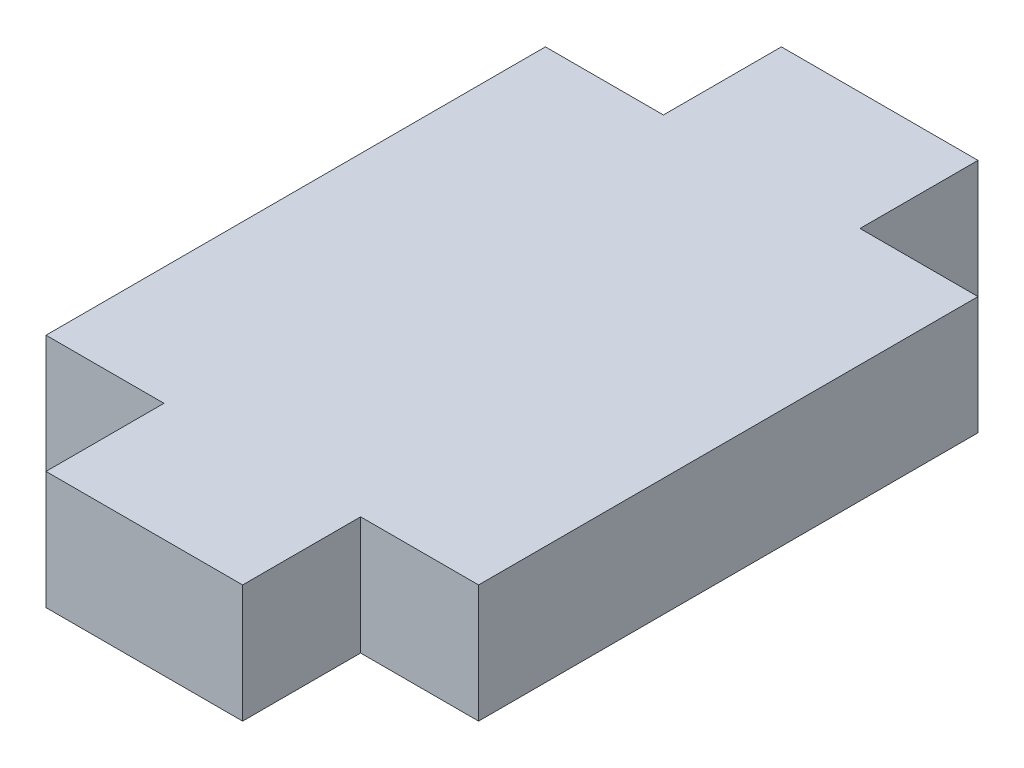
ISO-10303-21;
HEADER;
FILE_DESCRIPTION(('STEP AP214'),'2;1');
FILE_NAME('part.step','',(''),(''),'','','');
FILE_SCHEMA(('AUTOMOTIVE_DESIGN { 1 0 10303 214 1 1 1 1 }'));
ENDSEC;
DATA;
#1=APPLICATION_CONTEXT('core data for automotive mechanical design processes');
#2=APPLICATION_PROTOCOL_DEFINITION('international standard','automotive_design',2000,#1);
#3=PRODUCT_CONTEXT('',#1,'mechanical');
#4=PRODUCT('Part','Part','',(#3));
#5=PRODUCT_RELATED_PRODUCT_CATEGORY('part','',(#4));
#6=PRODUCT_DEFINITION_FORMATION('','',#4);
#7=PRODUCT_DEFINITION_CONTEXT('part definition',#1,'design');
#8=PRODUCT_DEFINITION('design','',#6,#7);
#9=PRODUCT_DEFINITION_SHAPE('','',#8);
#10=(LENGTH_UNIT() NAMED_UNIT(*) SI_UNIT(.MILLI.,.METRE.));
#11=(NAMED_UNIT(*) PLANE_ANGLE_UNIT() SI_UNIT($,.RADIAN.));
#12=(NAMED_UNIT(*) SI_UNIT($,.STERADIAN.) SOLID_ANGLE_UNIT());
#13=UNCERTAINTY_MEASURE_WITH_UNIT(LENGTH_MEASURE(1.E-05),#10,'distance_accuracy_value','');
#14=(GEOMETRIC_REPRESENTATION_CONTEXT(3) GLOBAL_UNCERTAINTY_ASSIGNED_CONTEXT((#13)) GLOBAL_UNIT_ASSIGNED_CONTEXT((#10,
#11,#12)) REPRESENTATION_CONTEXT('',''));
#15=CARTESIAN_POINT('',(0.,0.,0.));
#16=DIRECTION('',(0.,0.,1.));
#17=DIRECTION('',(1.,0.,0.));
#18=AXIS2_PLACEMENT_3D('',#15,#16,#17);
#19=CARTESIAN_POINT('',(-2.5,1.5,-6.35));
#20=DIRECTION('',(0.,0.,1.));
#21=DIRECTION('',(1.,0.,0.));
#22=AXIS2_PLACEMENT_3D('',#19,#20,#21);
#23=PLANE('',#22);
#24=DIRECTION('',(-1.,0.,0.));
#25=VECTOR('',#24,1.);
#26=CARTESIAN_POINT('',(-2.5,-1.5,-6.35));
#27=LINE('',#26,#25);
#28=CARTESIAN_POINT('',(-2.5,-1.5,-6.35));
#29=VERTEX_POINT('',#28);
#30=CARTESIAN_POINT('',(-5.5,-1.5,-6.35));
#31=VERTEX_POINT('',#30);
#32=EDGE_CURVE('E161',#29,#31,#27,.T.);
#33=ORIENTED_EDGE('',*,*,#32,.T.);
#34=DIRECTION('',(0.,-1.,0.));
#35=VECTOR('',#34,1.);
#36=CARTESIAN_POINT('',(-5.5,1.5,-6.35));
#37=LINE('',#36,#35);
#38=CARTESIAN_POINT('',(-5.5,1.5,-6.35));
#39=VERTEX_POINT('',#38);
#40=EDGE_CURVE('E11',#39,#31,#37,.T.);
#41=ORIENTED_EDGE('',*,*,#40,.F.);
#42=DIRECTION('',(-1.,0.,0.));
#43=VECTOR('',#42,1.);
#44=CARTESIAN_POINT('',(-2.5,1.5,-6.35));
#45=LINE('',#44,#43);
#46=CARTESIAN_POINT('',(-2.5,1.5,-6.35));
#47=VERTEX_POINT('',#46);
#48=EDGE_CURVE('E183',#47,#39,#45,.T.);
#49=ORIENTED_EDGE('',*,*,#48,.F.);
#50=DIRECTION('',(0.,-1.,0.));
#51=VECTOR('',#50,1.);
#52=CARTESIAN_POINT('',(-2.5,1.5,-6.35));
#53=LINE('',#52,#51);
#54=EDGE_CURVE('E157',#47,#29,#53,.T.);
#55=ORIENTED_EDGE('',*,*,#54,.T.);
#56=EDGE_LOOP('',(#33,#41,#49,#55));
#57=FACE_BOUND('',#56,.T.);
#58=ADVANCED_FACE('F41',(#57),#23,.F.);
#59=CARTESIAN_POINT('',(-5.5,1.5,-6.35));
#60=DIRECTION('',(1.,0.,0.));
#61=DIRECTION('',(0.,0.,-1.));
#62=AXIS2_PLACEMENT_3D('',#59,#60,#61);
#63=PLANE('',#62);
#64=DIRECTION('',(0.,0.,1.));
#65=VECTOR('',#64,1.);
#66=CARTESIAN_POINT('',(-5.5,-1.5,-6.35));
#67=LINE('',#66,#65);
#68=CARTESIAN_POINT('',(-5.5,-1.5,6.35));
#69=VERTEX_POINT('',#68);
#70=EDGE_CURVE('E164',#31,#69,#67,.T.);
#71=ORIENTED_EDGE('',*,*,#70,.T.);
#72=DIRECTION('',(0.,-1.,0.));
#73=VECTOR('',#72,1.);
#74=CARTESIAN_POINT('',(-5.5,1.5,6.35));
#75=LINE('',#74,#73);
#76=CARTESIAN_POINT('',(-5.5,1.5,6.35));
#77=VERTEX_POINT('',#76);
#78=EDGE_CURVE('E49',#77,#69,#75,.T.);
#79=ORIENTED_EDGE('',*,*,#78,.F.);
#80=DIRECTION('',(0.,0.,1.));
#81=VECTOR('',#80,1.);
#82=CARTESIAN_POINT('',(-5.5,1.5,-6.35));
#83=LINE('',#82,#81);
#84=EDGE_CURVE('E112',#39,#77,#83,.T.);
#85=ORIENTED_EDGE('',*,*,#84,.F.);
#86=ORIENTED_EDGE('',*,*,#40,.T.);
#87=EDGE_LOOP('',(#71,#79,#85,#86));
#88=FACE_BOUND('',#87,.T.);
#89=ADVANCED_FACE('F261',(#88),#63,.F.);
#90=CARTESIAN_POINT('',(-5.5,1.5,6.35));
#91=DIRECTION('',(0.,0.,-1.));
#92=DIRECTION('',(-1.,0.,0.));
#93=AXIS2_PLACEMENT_3D('',#90,#91,#92);
#94=PLANE('',#93);
#95=DIRECTION('',(1.,0.,0.));
#96=VECTOR('',#95,1.);
#97=CARTESIAN_POINT('',(-5.5,-1.5,6.35));
#98=LINE('',#97,#96);
#99=CARTESIAN_POINT('',(-2.5,-1.5,6.35));
#100=VERTEX_POINT('',#99);
#101=EDGE_CURVE('E166',#69,#100,#98,.T.);
#102=ORIENTED_EDGE('',*,*,#101,.T.);
#103=DIRECTION('',(0.,-1.,0.));
#104=VECTOR('',#103,1.);
#105=CARTESIAN_POINT('',(-2.5,1.5,6.35));
#106=LINE('',#105,#104);
#107=CARTESIAN_POINT('',(-2.5,1.5,6.35));
#108=VERTEX_POINT('',#107);
#109=EDGE_CURVE('E202',#108,#100,#106,.T.);
#110=ORIENTED_EDGE('',*,*,#109,.F.);
#111=DIRECTION('',(1.,0.,0.));
#112=VECTOR('',#111,1.);
#113=CARTESIAN_POINT('',(-5.5,1.5,6.35));
#114=LINE('',#113,#112);
#115=EDGE_CURVE('E210',#77,#108,#114,.T.);
#116=ORIENTED_EDGE('',*,*,#115,.F.);
#117=ORIENTED_EDGE('',*,*,#78,.T.);
#118=EDGE_LOOP('',(#102,#110,#116,#117));
#119=FACE_BOUND('',#118,.T.);
#120=ADVANCED_FACE('F208',(#119),#94,.F.);
#121=CARTESIAN_POINT('',(-2.5,1.5,6.35));
#122=DIRECTION('',(1.,0.,0.));
#123=DIRECTION('',(0.,0.,-1.));
#124=AXIS2_PLACEMENT_3D('',#121,#122,#123);
#125=PLANE('',#124);
#126=DIRECTION('',(0.,0.,1.));
#127=VECTOR('',#126,1.);
#128=CARTESIAN_POINT('',(-2.5,-1.5,6.35));
#129=LINE('',#128,#127);
#130=CARTESIAN_POINT('',(-2.5,-1.5,9.35));
#131=VERTEX_POINT('',#130);
#132=EDGE_CURVE('E168',#100,#131,#129,.T.);
#133=ORIENTED_EDGE('',*,*,#132,.T.);
#134=DIRECTION('',(0.,-1.,0.));
#135=VECTOR('',#134,1.);
#136=CARTESIAN_POINT('',(-2.5,1.5,9.35));
#137=LINE('',#136,#135);
#138=CARTESIAN_POINT('',(-2.5,1.5,9.35));
#139=VERTEX_POINT('',#138);
#140=EDGE_CURVE('E199',#139,#131,#137,.T.);
#141=ORIENTED_EDGE('',*,*,#140,.F.);
#142=DIRECTION('',(0.,0.,1.));
#143=VECTOR('',#142,1.);
#144=CARTESIAN_POINT('',(-2.5,1.5,6.35));
#145=LINE('',#144,#143);
#146=EDGE_CURVE('E228',#108,#139,#145,.T.);
#147=ORIENTED_EDGE('',*,*,#146,.F.);
#148=ORIENTED_EDGE('',*,*,#109,.T.);
#149=EDGE_LOOP('',(#133,#141,#147,#148));
#150=FACE_BOUND('',#149,.T.);
#151=ADVANCED_FACE('F219',(#150),#125,.F.);
#152=CARTESIAN_POINT('',(-2.5,1.5,9.35));
#153=DIRECTION('',(0.,0.,-1.));
#154=DIRECTION('',(-1.,0.,0.));
#155=AXIS2_PLACEMENT_3D('',#152,#153,#154);
#156=PLANE('',#155);
#157=DIRECTION('',(1.,0.,0.));
#158=VECTOR('',#157,1.);
#159=CARTESIAN_POINT('',(-2.5,-1.5,9.35));
#160=LINE('',#159,#158);
#161=CARTESIAN_POINT('',(2.5,-1.5,9.35));
#162=VERTEX_POINT('',#161);
#163=EDGE_CURVE('E170',#131,#162,#160,.T.);
#164=ORIENTED_EDGE('',*,*,#163,.T.);
#165=DIRECTION('',(0.,-1.,0.));
#166=VECTOR('',#165,1.);
#167=CARTESIAN_POINT('',(2.5,1.5,9.35));
#168=LINE('',#167,#166);
#169=CARTESIAN_POINT('',(2.5,1.5,9.35));
#170=VERTEX_POINT('',#169);
#171=EDGE_CURVE('E196',#170,#162,#168,.T.);
#172=ORIENTED_EDGE('',*,*,#171,.F.);
#173=DIRECTION('',(1.,0.,0.));
#174=VECTOR('',#173,1.);
#175=CARTESIAN_POINT('',(-2.5,1.5,9.35));
#176=LINE('',#175,#174);
#177=EDGE_CURVE('E225',#139,#170,#176,.T.);
#178=ORIENTED_EDGE('',*,*,#177,.F.);
#179=ORIENTED_EDGE('',*,*,#140,.T.);
#180=EDGE_LOOP('',(#164,#172,#178,#179));
#181=FACE_BOUND('',#180,.T.);
#182=ADVANCED_FACE('F223',(#181),#156,.F.);
#183=CARTESIAN_POINT('',(2.5,1.5,9.35));
#184=DIRECTION('',(-1.,0.,0.));
#185=DIRECTION('',(0.,0.,1.));
#186=AXIS2_PLACEMENT_3D('',#183,#184,#185);
#187=PLANE('',#186);
#188=DIRECTION('',(0.,0.,-1.));
#189=VECTOR('',#188,1.);
#190=CARTESIAN_POINT('',(2.5,-1.5,9.35));
#191=LINE('',#190,#189);
#192=CARTESIAN_POINT('',(2.5,-1.5,6.35));
#193=VERTEX_POINT('',#192);
#194=EDGE_CURVE('E172',#162,#193,#191,.T.);
#195=ORIENTED_EDGE('',*,*,#194,.T.);
#196=DIRECTION('',(0.,-1.,0.));
#197=VECTOR('',#196,1.);
#198=CARTESIAN_POINT('',(2.5,1.5,6.35));
#199=LINE('',#198,#197);
#200=CARTESIAN_POINT('',(2.5,1.5,6.35));
#201=VERTEX_POINT('',#200);
#202=EDGE_CURVE('E193',#201,#193,#199,.T.);
#203=ORIENTED_EDGE('',*,*,#202,.F.);
#204=DIRECTION('',(0.,0.,-1.));
#205=VECTOR('',#204,1.);
#206=CARTESIAN_POINT('',(2.5,1.5,9.35));
#207=LINE('',#206,#205);
#208=EDGE_CURVE('E227',#170,#201,#207,.T.);
#209=ORIENTED_EDGE('',*,*,#208,.F.);
#210=ORIENTED_EDGE('',*,*,#171,.T.);
#211=EDGE_LOOP('',(#195,#203,#209,#210));
#212=FACE_BOUND('',#211,.T.);
#213=ADVANCED_FACE('F274',(#212),#187,.F.);
#214=CARTESIAN_POINT('',(2.5,1.5,6.35));
#215=DIRECTION('',(0.,0.,-1.));
#216=DIRECTION('',(-1.,0.,0.));
#217=AXIS2_PLACEMENT_3D('',#214,#215,#216);
#218=PLANE('',#217);
#219=DIRECTION('',(1.,0.,0.));
#220=VECTOR('',#219,1.);
#221=CARTESIAN_POINT('',(2.5,-1.5,6.35));
#222=LINE('',#221,#220);
#223=CARTESIAN_POINT('',(5.5,-1.5,6.35));
#224=VERTEX_POINT('',#223);
#225=EDGE_CURVE('E174',#193,#224,#222,.T.);
#226=ORIENTED_EDGE('',*,*,#225,.T.);
#227=DIRECTION('',(0.,-1.,0.));
#228=VECTOR('',#227,1.);
#229=CARTESIAN_POINT('',(5.5,1.5,6.35));
#230=LINE('',#229,#228);
#231=CARTESIAN_POINT('',(5.5,1.5,6.35));
#232=VERTEX_POINT('',#231);
#233=EDGE_CURVE('E190',#232,#224,#230,.T.);
#234=ORIENTED_EDGE('',*,*,#233,.F.);
#235=DIRECTION('',(1.,0.,0.));
#236=VECTOR('',#235,1.);
#237=CARTESIAN_POINT('',(2.5,1.5,6.35));
#238=LINE('',#237,#236);
#239=EDGE_CURVE('E230',#201,#232,#238,.T.);
#240=ORIENTED_EDGE('',*,*,#239,.F.);
#241=ORIENTED_EDGE('',*,*,#202,.T.);
#242=EDGE_LOOP('',(#226,#234,#240,#241));
#243=FACE_BOUND('',#242,.T.);
#244=ADVANCED_FACE('F277',(#243),#218,.F.);
#245=CARTESIAN_POINT('',(5.5,1.5,6.35));
#246=DIRECTION('',(-1.,0.,0.));
#247=DIRECTION('',(0.,0.,1.));
#248=AXIS2_PLACEMENT_3D('',#245,#246,#247);
#249=PLANE('',#248);
#250=DIRECTION('',(0.,0.,-1.));
#251=VECTOR('',#250,1.);
#252=CARTESIAN_POINT('',(5.5,-1.5,6.35));
#253=LINE('',#252,#251);
#254=CARTESIAN_POINT('',(5.5,-1.5,-6.35));
#255=VERTEX_POINT('',#254);
#256=EDGE_CURVE('E176',#224,#255,#253,.T.);
#257=ORIENTED_EDGE('',*,*,#256,.T.);
#258=DIRECTION('',(0.,-1.,0.));
#259=VECTOR('',#258,1.);
#260=CARTESIAN_POINT('',(5.5,1.5,-6.35));
#261=LINE('',#260,#259);
#262=CARTESIAN_POINT('',(5.5,1.5,-6.35));
#263=VERTEX_POINT('',#262);
#264=EDGE_CURVE('E187',#263,#255,#261,.T.);
#265=ORIENTED_EDGE('',*,*,#264,.F.);
#266=DIRECTION('',(0.,0.,-1.));
#267=VECTOR('',#266,1.);
#268=CARTESIAN_POINT('',(5.5,1.5,6.35));
#269=LINE('',#268,#267);
#270=EDGE_CURVE('E236',#232,#263,#269,.T.);
#271=ORIENTED_EDGE('',*,*,#270,.F.);
#272=ORIENTED_EDGE('',*,*,#233,.T.);
#273=EDGE_LOOP('',(#257,#265,#271,#272));
#274=FACE_BOUND('',#273,.T.);
#275=ADVANCED_FACE('F242',(#274),#249,.F.);
#276=CARTESIAN_POINT('',(5.5,1.5,-6.35));
#277=DIRECTION('',(0.,0.,1.));
#278=DIRECTION('',(1.,0.,0.));
#279=AXIS2_PLACEMENT_3D('',#276,#277,#278);
#280=PLANE('',#279);
#281=DIRECTION('',(-1.,0.,0.));
#282=VECTOR('',#281,1.);
#283=CARTESIAN_POINT('',(5.5,-1.5,-6.35));
#284=LINE('',#283,#282);
#285=CARTESIAN_POINT('',(2.5,-1.5,-6.35));
#286=VERTEX_POINT('',#285);
#287=EDGE_CURVE('E178',#255,#286,#284,.T.);
#288=ORIENTED_EDGE('',*,*,#287,.T.);
#289=DIRECTION('',(0.,-1.,0.));
#290=VECTOR('',#289,1.);
#291=CARTESIAN_POINT('',(2.5,1.5,-6.35));
#292=LINE('',#291,#290);
#293=CARTESIAN_POINT('',(2.5,1.5,-6.35));
#294=VERTEX_POINT('',#293);
#295=EDGE_CURVE('E152',#294,#286,#292,.T.);
#296=ORIENTED_EDGE('',*,*,#295,.F.);
#297=DIRECTION('',(-1.,0.,0.));
#298=VECTOR('',#297,1.);
#299=CARTESIAN_POINT('',(5.5,1.5,-6.35));
#300=LINE('',#299,#298);
#301=EDGE_CURVE('E143',#263,#294,#300,.T.);
#302=ORIENTED_EDGE('',*,*,#301,.F.);
#303=ORIENTED_EDGE('',*,*,#264,.T.);
#304=EDGE_LOOP('',(#288,#296,#302,#303));
#305=FACE_BOUND('',#304,.T.);
#306=ADVANCED_FACE('F246',(#305),#280,.F.);
#307=CARTESIAN_POINT('',(2.5,1.5,-6.35));
#308=DIRECTION('',(-1.,0.,0.));
#309=DIRECTION('',(0.,0.,1.));
#310=AXIS2_PLACEMENT_3D('',#307,#308,#309);
#311=PLANE('',#310);
#312=DIRECTION('',(0.,0.,-1.));
#313=VECTOR('',#312,1.);
#314=CARTESIAN_POINT('',(2.5,-1.5,-6.35));
#315=LINE('',#314,#313);
#316=CARTESIAN_POINT('',(2.5,-1.5,-9.35));
#317=VERTEX_POINT('',#316);
#318=EDGE_CURVE('E151',#286,#317,#315,.T.);
#319=ORIENTED_EDGE('',*,*,#318,.T.);
#320=DIRECTION('',(0.,-1.,0.));
#321=VECTOR('',#320,1.);
#322=CARTESIAN_POINT('',(2.5,1.5,-9.35));
#323=LINE('',#322,#321);
#324=CARTESIAN_POINT('',(2.5,1.5,-9.35));
#325=VERTEX_POINT('',#324);
#326=EDGE_CURVE('E148',#325,#317,#323,.T.);
#327=ORIENTED_EDGE('',*,*,#326,.F.);
#328=DIRECTION('',(0.,0.,-1.));
#329=VECTOR('',#328,1.);
#330=CARTESIAN_POINT('',(2.5,1.5,-6.35));
#331=LINE('',#330,#329);
#332=EDGE_CURVE('E137',#294,#325,#331,.T.);
#333=ORIENTED_EDGE('',*,*,#332,.F.);
#334=ORIENTED_EDGE('',*,*,#295,.T.);
#335=EDGE_LOOP('',(#319,#327,#333,#334));
#336=FACE_BOUND('',#335,.T.);
#337=ADVANCED_FACE('F149',(#336),#311,.F.);
#338=CARTESIAN_POINT('',(2.5,1.5,-9.35));
#339=DIRECTION('',(0.,0.,1.));
#340=DIRECTION('',(1.,0.,0.));
#341=AXIS2_PLACEMENT_3D('',#338,#339,#340);
#342=PLANE('',#341);
#343=DIRECTION('',(-1.,0.,0.));
#344=VECTOR('',#343,1.);
#345=CARTESIAN_POINT('',(2.5,-1.5,-9.35));
#346=LINE('',#345,#344);
#347=CARTESIAN_POINT('',(-2.5,-1.5,-9.35));
#348=VERTEX_POINT('',#347);
#349=EDGE_CURVE('E98',#317,#348,#346,.T.);
#350=ORIENTED_EDGE('',*,*,#349,.T.);
#351=DIRECTION('',(0.,-1.,0.));
#352=VECTOR('',#351,1.);
#353=CARTESIAN_POINT('',(-2.5,1.5,-9.35));
#354=LINE('',#353,#352);
#355=CARTESIAN_POINT('',(-2.5,1.5,-9.35));
#356=VERTEX_POINT('',#355);
#357=EDGE_CURVE('E153',#356,#348,#354,.T.);
#358=ORIENTED_EDGE('',*,*,#357,.F.);
#359=DIRECTION('',(-1.,0.,0.));
#360=VECTOR('',#359,1.);
#361=CARTESIAN_POINT('',(2.5,1.5,-9.35));
#362=LINE('',#361,#360);
#363=EDGE_CURVE('E141',#325,#356,#362,.T.);
#364=ORIENTED_EDGE('',*,*,#363,.F.);
#365=ORIENTED_EDGE('',*,*,#326,.T.);
#366=EDGE_LOOP('',(#350,#358,#364,#365));
#367=FACE_BOUND('',#366,.T.);
#368=ADVANCED_FACE('F155',(#367),#342,.F.);
#369=CARTESIAN_POINT('',(-2.5,1.5,-9.35));
#370=DIRECTION('',(1.,0.,0.));
#371=DIRECTION('',(0.,0.,-1.));
#372=AXIS2_PLACEMENT_3D('',#369,#370,#371);
#373=PLANE('',#372);
#374=DIRECTION('',(0.,0.,1.));
#375=VECTOR('',#374,1.);
#376=CARTESIAN_POINT('',(-2.5,-1.5,-9.35));
#377=LINE('',#376,#375);
#378=EDGE_CURVE('E104',#348,#29,#377,.T.);
#379=ORIENTED_EDGE('',*,*,#378,.T.);
#380=ORIENTED_EDGE('',*,*,#54,.F.);
#381=DIRECTION('',(0.,0.,1.));
#382=VECTOR('',#381,1.);
#383=CARTESIAN_POINT('',(-2.5,1.5,-9.35));
#384=LINE('',#383,#382);
#385=EDGE_CURVE('E57',#356,#47,#384,.T.);
#386=ORIENTED_EDGE('',*,*,#385,.F.);
#387=ORIENTED_EDGE('',*,*,#357,.T.);
#388=EDGE_LOOP('',(#379,#380,#386,#387));
#389=FACE_BOUND('',#388,.T.);
#390=ADVANCED_FACE('F250',(#389),#373,.F.);
#391=CARTESIAN_POINT('',(0.,1.5,0.));
#392=DIRECTION('',(0.,1.,0.));
#393=DIRECTION('',(0.,0.,1.));
#394=AXIS2_PLACEMENT_3D('',#391,#392,#393);
#395=PLANE('',#394);
#396=ORIENTED_EDGE('',*,*,#48,.T.);
#397=ORIENTED_EDGE('',*,*,#84,.T.);
#398=ORIENTED_EDGE('',*,*,#115,.T.);
#399=ORIENTED_EDGE('',*,*,#146,.T.);
#400=ORIENTED_EDGE('',*,*,#177,.T.);
#401=ORIENTED_EDGE('',*,*,#208,.T.);
#402=ORIENTED_EDGE('',*,*,#239,.T.);
#403=ORIENTED_EDGE('',*,*,#270,.T.);
#404=ORIENTED_EDGE('',*,*,#301,.T.);
#405=ORIENTED_EDGE('',*,*,#332,.T.);
#406=ORIENTED_EDGE('',*,*,#363,.T.);
#407=ORIENTED_EDGE('',*,*,#385,.T.);
#408=EDGE_LOOP('',(#396,#397,#398,#399,#400,#401,#402,#403,#404,#405,#406,#407));
#409=FACE_BOUND('',#408,.T.);
#410=ADVANCED_FACE('F139',(#409),#395,.T.);
#411=CARTESIAN_POINT('',(0.,-1.5,0.));
#412=DIRECTION('',(0.,1.,0.));
#413=DIRECTION('',(0.,0.,1.));
#414=AXIS2_PLACEMENT_3D('',#411,#412,#413);
#415=PLANE('',#414);
#416=ORIENTED_EDGE('',*,*,#32,.F.);
#417=ORIENTED_EDGE('',*,*,#378,.F.);
#418=ORIENTED_EDGE('',*,*,#349,.F.);
#419=ORIENTED_EDGE('',*,*,#318,.F.);
#420=ORIENTED_EDGE('',*,*,#287,.F.);
#421=ORIENTED_EDGE('',*,*,#256,.F.);
#422=ORIENTED_EDGE('',*,*,#225,.F.);
#423=ORIENTED_EDGE('',*,*,#194,.F.);
#424=ORIENTED_EDGE('',*,*,#163,.F.);
#425=ORIENTED_EDGE('',*,*,#132,.F.);
#426=ORIENTED_EDGE('',*,*,#101,.F.);
#427=ORIENTED_EDGE('',*,*,#70,.F.);
#428=EDGE_LOOP('',(#416,#417,#418,#419,#420,#421,#422,#423,#424,#425,#426,#427));
#429=FACE_BOUND('',#428,.T.);
#430=ADVANCED_FACE('F214',(#429),#415,.F.);
#431=CLOSED_SHELL('',(#58,#89,#120,#151,#182,#213,#244,#275,#306,#337,#368,#390,#410,#430));
#432=MANIFOLD_SOLID_BREP('B2',#431);
#433=ADVANCED_BREP_SHAPE_REPRESENTATION('',(#18,#432),#14);
#434=SHAPE_DEFINITION_REPRESENTATION(#9,#433);
ENDSEC;
END-ISO-10303-21;
